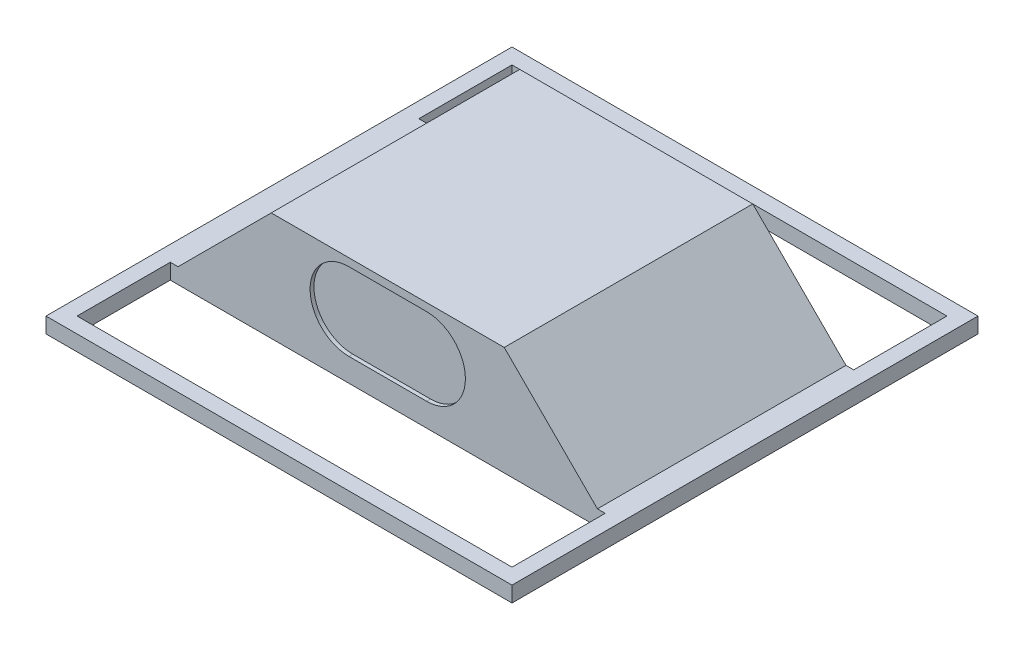
ISO-10303-21;
HEADER;
FILE_DESCRIPTION(('STEP AP214'),'2;1');
FILE_NAME('part.step','',(''),(''),'','','');
FILE_SCHEMA(('AUTOMOTIVE_DESIGN { 1 0 10303 214 1 1 1 1 }'));
ENDSEC;
DATA;
#1=APPLICATION_CONTEXT('core data for automotive mechanical design processes');
#2=APPLICATION_PROTOCOL_DEFINITION('international standard','automotive_design',2000,#1);
#3=PRODUCT_CONTEXT('',#1,'mechanical');
#4=PRODUCT('Part','Part','',(#3));
#5=PRODUCT_RELATED_PRODUCT_CATEGORY('part','',(#4));
#6=PRODUCT_DEFINITION_FORMATION('','',#4);
#7=PRODUCT_DEFINITION_CONTEXT('part definition',#1,'design');
#8=PRODUCT_DEFINITION('design','',#6,#7);
#9=PRODUCT_DEFINITION_SHAPE('','',#8);
#10=(LENGTH_UNIT() NAMED_UNIT(*) SI_UNIT(.MILLI.,.METRE.));
#11=(NAMED_UNIT(*) PLANE_ANGLE_UNIT() SI_UNIT($,.RADIAN.));
#12=(NAMED_UNIT(*) SI_UNIT($,.STERADIAN.) SOLID_ANGLE_UNIT());
#13=UNCERTAINTY_MEASURE_WITH_UNIT(LENGTH_MEASURE(1.E-05),#10,'distance_accuracy_value','');
#14=(GEOMETRIC_REPRESENTATION_CONTEXT(3) GLOBAL_UNCERTAINTY_ASSIGNED_CONTEXT((#13)) GLOBAL_UNIT_ASSIGNED_CONTEXT((#10,
#11,#12)) REPRESENTATION_CONTEXT('',''));
#15=CARTESIAN_POINT('',(0.,0.,0.));
#16=DIRECTION('',(0.,0.,1.));
#17=DIRECTION('',(1.,0.,0.));
#18=AXIS2_PLACEMENT_3D('',#15,#16,#17);
#19=CARTESIAN_POINT('',(0.,20.,0.));
#20=DIRECTION('',(0.,1.,0.));
#21=DIRECTION('',(0.,0.,1.));
#22=AXIS2_PLACEMENT_3D('',#19,#20,#21);
#23=PLANE('',#22);
#24=DIRECTION('',(0.,0.,1.));
#25=VECTOR('',#24,1.);
#26=CARTESIAN_POINT('',(-269.999999999996,20.,-160.));
#27=LINE('',#26,#25);
#28=CARTESIAN_POINT('',(-269.999999999996,20.,-160.));
#29=VERTEX_POINT('',#28);
#30=CARTESIAN_POINT('',(-269.999999999996,20.,160.));
#31=VERTEX_POINT('',#30);
#32=EDGE_CURVE('E282',#29,#31,#27,.T.);
#33=ORIENTED_EDGE('',*,*,#32,.F.);
#34=DIRECTION('',(1.,0.,0.));
#35=VECTOR('',#34,1.);
#36=CARTESIAN_POINT('',(-280.,20.,-160.));
#37=LINE('',#36,#35);
#38=CARTESIAN_POINT('',(-280.,20.,-160.));
#39=VERTEX_POINT('',#38);
#40=EDGE_CURVE('E292',#39,#29,#37,.T.);
#41=ORIENTED_EDGE('',*,*,#40,.F.);
#42=DIRECTION('',(0.,0.,1.));
#43=VECTOR('',#42,1.);
#44=CARTESIAN_POINT('',(-280.,20.,-160.));
#45=LINE('',#44,#43);
#46=CARTESIAN_POINT('',(-280.,20.,-280.));
#47=VERTEX_POINT('',#46);
#48=EDGE_CURVE('E301',#47,#39,#45,.T.);
#49=ORIENTED_EDGE('',*,*,#48,.F.);
#50=DIRECTION('',(-1.,0.,0.));
#51=VECTOR('',#50,1.);
#52=CARTESIAN_POINT('',(-280.,20.,-280.));
#53=LINE('',#52,#51);
#54=CARTESIAN_POINT('',(280.,20.,-280.));
#55=VERTEX_POINT('',#54);
#56=EDGE_CURVE('E298',#55,#47,#53,.T.);
#57=ORIENTED_EDGE('',*,*,#56,.F.);
#58=DIRECTION('',(0.,0.,-1.));
#59=VECTOR('',#58,1.);
#60=CARTESIAN_POINT('',(280.,20.,-160.));
#61=LINE('',#60,#59);
#62=CARTESIAN_POINT('',(280.,20.,-160.));
#63=VERTEX_POINT('',#62);
#64=EDGE_CURVE('E295',#63,#55,#61,.T.);
#65=ORIENTED_EDGE('',*,*,#64,.F.);
#66=CARTESIAN_POINT('',(269.999999999996,20.,-160.));
#67=VERTEX_POINT('',#66);
#68=EDGE_CURVE('E296',#67,#63,#37,.T.);
#69=ORIENTED_EDGE('',*,*,#68,.F.);
#70=DIRECTION('',(0.,0.,1.));
#71=VECTOR('',#70,1.);
#72=CARTESIAN_POINT('',(269.999999999996,20.,-160.));
#73=LINE('',#72,#71);
#74=CARTESIAN_POINT('',(269.999999999996,20.,160.));
#75=VERTEX_POINT('',#74);
#76=EDGE_CURVE('E275',#67,#75,#73,.T.);
#77=ORIENTED_EDGE('',*,*,#76,.T.);
#78=DIRECTION('',(-1.,0.,0.));
#79=VECTOR('',#78,1.);
#80=CARTESIAN_POINT('',(-280.,20.,160.));
#81=LINE('',#80,#79);
#82=CARTESIAN_POINT('',(280.,20.,160.));
#83=VERTEX_POINT('',#82);
#84=EDGE_CURVE('E333',#83,#75,#81,.T.);
#85=ORIENTED_EDGE('',*,*,#84,.F.);
#86=DIRECTION('',(0.,0.,-1.));
#87=VECTOR('',#86,1.);
#88=CARTESIAN_POINT('',(280.,20.,160.));
#89=LINE('',#88,#87);
#90=CARTESIAN_POINT('',(280.,20.,280.));
#91=VERTEX_POINT('',#90);
#92=EDGE_CURVE('E329',#91,#83,#89,.T.);
#93=ORIENTED_EDGE('',*,*,#92,.F.);
#94=DIRECTION('',(1.,0.,0.));
#95=VECTOR('',#94,1.);
#96=CARTESIAN_POINT('',(-280.,20.,280.));
#97=LINE('',#96,#95);
#98=CARTESIAN_POINT('',(-280.,20.,280.));
#99=VERTEX_POINT('',#98);
#100=EDGE_CURVE('E326',#99,#91,#97,.T.);
#101=ORIENTED_EDGE('',*,*,#100,.F.);
#102=DIRECTION('',(0.,0.,1.));
#103=VECTOR('',#102,1.);
#104=CARTESIAN_POINT('',(-280.,20.,160.));
#105=LINE('',#104,#103);
#106=CARTESIAN_POINT('',(-280.,20.,160.));
#107=VERTEX_POINT('',#106);
#108=EDGE_CURVE('E324',#107,#99,#105,.T.);
#109=ORIENTED_EDGE('',*,*,#108,.F.);
#110=EDGE_CURVE('E332',#31,#107,#81,.T.);
#111=ORIENTED_EDGE('',*,*,#110,.F.);
#112=EDGE_LOOP('',(#33,#41,#49,#57,#65,#69,#77,#85,#93,#101,#109,#111));
#113=FACE_BOUND('',#112,.T.);
#114=DIRECTION('',(-1.,0.,0.));
#115=VECTOR('',#114,1.);
#116=CARTESIAN_POINT('',(-300.,20.,-300.));
#117=LINE('',#116,#115);
#118=CARTESIAN_POINT('',(300.,20.,-300.));
#119=VERTEX_POINT('',#118);
#120=CARTESIAN_POINT('',(-300.,20.,-300.));
#121=VERTEX_POINT('',#120);
#122=EDGE_CURVE('E356',#119,#121,#117,.T.);
#123=ORIENTED_EDGE('',*,*,#122,.T.);
#124=DIRECTION('',(0.,0.,1.));
#125=VECTOR('',#124,1.);
#126=CARTESIAN_POINT('',(-300.,20.,300.));
#127=LINE('',#126,#125);
#128=CARTESIAN_POINT('',(-300.,20.,300.));
#129=VERTEX_POINT('',#128);
#130=EDGE_CURVE('E359',#121,#129,#127,.T.);
#131=ORIENTED_EDGE('',*,*,#130,.T.);
#132=DIRECTION('',(1.,0.,0.));
#133=VECTOR('',#132,1.);
#134=CARTESIAN_POINT('',(-300.,20.,300.));
#135=LINE('',#134,#133);
#136=CARTESIAN_POINT('',(300.,20.,300.));
#137=VERTEX_POINT('',#136);
#138=EDGE_CURVE('E362',#129,#137,#135,.T.);
#139=ORIENTED_EDGE('',*,*,#138,.T.);
#140=DIRECTION('',(0.,0.,-1.));
#141=VECTOR('',#140,1.);
#142=CARTESIAN_POINT('',(300.,20.,300.));
#143=LINE('',#142,#141);
#144=EDGE_CURVE('E364',#137,#119,#143,.T.);
#145=ORIENTED_EDGE('',*,*,#144,.T.);
#146=EDGE_LOOP('',(#123,#131,#139,#145));
#147=FACE_BOUND('',#146,.T.);
#148=ADVANCED_FACE('F36',(#113,#147),#23,.T.);
#149=CARTESIAN_POINT('',(0.,0.,0.));
#150=DIRECTION('',(0.,1.,0.));
#151=DIRECTION('',(0.,0.,1.));
#152=AXIS2_PLACEMENT_3D('',#149,#150,#151);
#153=PLANE('',#152);
#154=DIRECTION('',(-1.,0.,0.));
#155=VECTOR('',#154,1.);
#156=CARTESIAN_POINT('',(-280.,0.,160.));
#157=LINE('',#156,#155);
#158=CARTESIAN_POINT('',(280.,0.,160.));
#159=VERTEX_POINT('',#158);
#160=CARTESIAN_POINT('',(-280.,0.,160.));
#161=VERTEX_POINT('',#160);
#162=EDGE_CURVE('E327',#159,#161,#157,.T.);
#163=ORIENTED_EDGE('',*,*,#162,.T.);
#164=DIRECTION('',(0.,0.,1.));
#165=VECTOR('',#164,1.);
#166=CARTESIAN_POINT('',(-280.,0.,160.));
#167=LINE('',#166,#165);
#168=CARTESIAN_POINT('',(-280.,0.,280.));
#169=VERTEX_POINT('',#168);
#170=EDGE_CURVE('E323',#161,#169,#167,.T.);
#171=ORIENTED_EDGE('',*,*,#170,.T.);
#172=DIRECTION('',(1.,0.,0.));
#173=VECTOR('',#172,1.);
#174=CARTESIAN_POINT('',(-280.,0.,280.));
#175=LINE('',#174,#173);
#176=CARTESIAN_POINT('',(280.,0.,280.));
#177=VERTEX_POINT('',#176);
#178=EDGE_CURVE('E339',#169,#177,#175,.T.);
#179=ORIENTED_EDGE('',*,*,#178,.T.);
#180=DIRECTION('',(0.,0.,-1.));
#181=VECTOR('',#180,1.);
#182=CARTESIAN_POINT('',(280.,0.,160.));
#183=LINE('',#182,#181);
#184=EDGE_CURVE('E342',#177,#159,#183,.T.);
#185=ORIENTED_EDGE('',*,*,#184,.T.);
#186=EDGE_LOOP('',(#163,#171,#179,#185));
#187=FACE_BOUND('',#186,.T.);
#188=DIRECTION('',(1.,0.,0.));
#189=VECTOR('',#188,1.);
#190=CARTESIAN_POINT('',(-280.,0.,-160.));
#191=LINE('',#190,#189);
#192=CARTESIAN_POINT('',(-280.,0.,-160.));
#193=VERTEX_POINT('',#192);
#194=CARTESIAN_POINT('',(280.,0.,-160.));
#195=VERTEX_POINT('',#194);
#196=EDGE_CURVE('E285',#193,#195,#191,.T.);
#197=ORIENTED_EDGE('',*,*,#196,.T.);
#198=DIRECTION('',(0.,0.,-1.));
#199=VECTOR('',#198,1.);
#200=CARTESIAN_POINT('',(280.,0.,-160.));
#201=LINE('',#200,#199);
#202=CARTESIAN_POINT('',(280.,0.,-280.));
#203=VERTEX_POINT('',#202);
#204=EDGE_CURVE('E305',#195,#203,#201,.T.);
#205=ORIENTED_EDGE('',*,*,#204,.T.);
#206=DIRECTION('',(-1.,0.,0.));
#207=VECTOR('',#206,1.);
#208=CARTESIAN_POINT('',(-280.,0.,-280.));
#209=LINE('',#208,#207);
#210=CARTESIAN_POINT('',(-280.,0.,-280.));
#211=VERTEX_POINT('',#210);
#212=EDGE_CURVE('E308',#203,#211,#209,.T.);
#213=ORIENTED_EDGE('',*,*,#212,.T.);
#214=DIRECTION('',(0.,0.,1.));
#215=VECTOR('',#214,1.);
#216=CARTESIAN_POINT('',(-280.,0.,-160.));
#217=LINE('',#216,#215);
#218=EDGE_CURVE('E311',#211,#193,#217,.T.);
#219=ORIENTED_EDGE('',*,*,#218,.T.);
#220=EDGE_LOOP('',(#197,#205,#213,#219));
#221=FACE_BOUND('',#220,.T.);
#222=DIRECTION('',(-1.,0.,0.));
#223=VECTOR('',#222,1.);
#224=CARTESIAN_POINT('',(-300.,0.,-300.));
#225=LINE('',#224,#223);
#226=CARTESIAN_POINT('',(300.,0.,-300.));
#227=VERTEX_POINT('',#226);
#228=CARTESIAN_POINT('',(-300.,0.,-300.));
#229=VERTEX_POINT('',#228);
#230=EDGE_CURVE('E355',#227,#229,#225,.T.);
#231=ORIENTED_EDGE('',*,*,#230,.F.);
#232=DIRECTION('',(0.,0.,-1.));
#233=VECTOR('',#232,1.);
#234=CARTESIAN_POINT('',(300.,0.,300.));
#235=LINE('',#234,#233);
#236=CARTESIAN_POINT('',(300.,0.,300.));
#237=VERTEX_POINT('',#236);
#238=EDGE_CURVE('E360',#237,#227,#235,.T.);
#239=ORIENTED_EDGE('',*,*,#238,.F.);
#240=DIRECTION('',(1.,0.,0.));
#241=VECTOR('',#240,1.);
#242=CARTESIAN_POINT('',(-300.,0.,300.));
#243=LINE('',#242,#241);
#244=CARTESIAN_POINT('',(-300.,0.,300.));
#245=VERTEX_POINT('',#244);
#246=EDGE_CURVE('E371',#245,#237,#243,.T.);
#247=ORIENTED_EDGE('',*,*,#246,.F.);
#248=DIRECTION('',(0.,0.,1.));
#249=VECTOR('',#248,1.);
#250=CARTESIAN_POINT('',(-300.,0.,300.));
#251=LINE('',#250,#249);
#252=EDGE_CURVE('E369',#229,#245,#251,.T.);
#253=ORIENTED_EDGE('',*,*,#252,.F.);
#254=EDGE_LOOP('',(#231,#239,#247,#253));
#255=FACE_BOUND('',#254,.T.);
#256=ADVANCED_FACE('F389',(#187,#221,#255),#153,.F.);
#257=CARTESIAN_POINT('',(-300.,20.,-300.));
#258=DIRECTION('',(0.,0.,1.));
#259=DIRECTION('',(1.,0.,0.));
#260=AXIS2_PLACEMENT_3D('',#257,#258,#259);
#261=PLANE('',#260);
#262=ORIENTED_EDGE('',*,*,#230,.T.);
#263=DIRECTION('',(0.,-1.,0.));
#264=VECTOR('',#263,1.);
#265=CARTESIAN_POINT('',(-300.,20.,-300.));
#266=LINE('',#265,#264);
#267=EDGE_CURVE('E11',#121,#229,#266,.T.);
#268=ORIENTED_EDGE('',*,*,#267,.F.);
#269=ORIENTED_EDGE('',*,*,#122,.F.);
#270=DIRECTION('',(0.,-1.,0.));
#271=VECTOR('',#270,1.);
#272=CARTESIAN_POINT('',(300.,20.,-300.));
#273=LINE('',#272,#271);
#274=EDGE_CURVE('E366',#119,#227,#273,.T.);
#275=ORIENTED_EDGE('',*,*,#274,.T.);
#276=EDGE_LOOP('',(#262,#268,#269,#275));
#277=FACE_BOUND('',#276,.T.);
#278=ADVANCED_FACE('F38',(#277),#261,.F.);
#279=CARTESIAN_POINT('',(-300.,20.,300.));
#280=DIRECTION('',(1.,0.,0.));
#281=DIRECTION('',(0.,0.,-1.));
#282=AXIS2_PLACEMENT_3D('',#279,#280,#281);
#283=PLANE('',#282);
#284=ORIENTED_EDGE('',*,*,#252,.T.);
#285=DIRECTION('',(0.,-1.,0.));
#286=VECTOR('',#285,1.);
#287=CARTESIAN_POINT('',(-300.,20.,300.));
#288=LINE('',#287,#286);
#289=EDGE_CURVE('E44',#129,#245,#288,.T.);
#290=ORIENTED_EDGE('',*,*,#289,.F.);
#291=ORIENTED_EDGE('',*,*,#130,.F.);
#292=ORIENTED_EDGE('',*,*,#267,.T.);
#293=EDGE_LOOP('',(#284,#290,#291,#292));
#294=FACE_BOUND('',#293,.T.);
#295=ADVANCED_FACE('F398',(#294),#283,.F.);
#296=CARTESIAN_POINT('',(-300.,20.,300.));
#297=DIRECTION('',(0.,0.,-1.));
#298=DIRECTION('',(-1.,0.,0.));
#299=AXIS2_PLACEMENT_3D('',#296,#297,#298);
#300=PLANE('',#299);
#301=ORIENTED_EDGE('',*,*,#246,.T.);
#302=DIRECTION('',(0.,-1.,0.));
#303=VECTOR('',#302,1.);
#304=CARTESIAN_POINT('',(300.,20.,300.));
#305=LINE('',#304,#303);
#306=EDGE_CURVE('E376',#137,#237,#305,.T.);
#307=ORIENTED_EDGE('',*,*,#306,.F.);
#308=ORIENTED_EDGE('',*,*,#138,.F.);
#309=ORIENTED_EDGE('',*,*,#289,.T.);
#310=EDGE_LOOP('',(#301,#307,#308,#309));
#311=FACE_BOUND('',#310,.T.);
#312=ADVANCED_FACE('F383',(#311),#300,.F.);
#313=CARTESIAN_POINT('',(300.,20.,300.));
#314=DIRECTION('',(-1.,0.,0.));
#315=DIRECTION('',(0.,0.,1.));
#316=AXIS2_PLACEMENT_3D('',#313,#314,#315);
#317=PLANE('',#316);
#318=ORIENTED_EDGE('',*,*,#238,.T.);
#319=ORIENTED_EDGE('',*,*,#274,.F.);
#320=ORIENTED_EDGE('',*,*,#144,.F.);
#321=ORIENTED_EDGE('',*,*,#306,.T.);
#322=EDGE_LOOP('',(#318,#319,#320,#321));
#323=FACE_BOUND('',#322,.T.);
#324=ADVANCED_FACE('F392',(#323),#317,.F.);
#325=CARTESIAN_POINT('',(-280.,20.,160.));
#326=DIRECTION('',(1.,0.,0.));
#327=DIRECTION('',(0.,0.,-1.));
#328=AXIS2_PLACEMENT_3D('',#325,#326,#327);
#329=PLANE('',#328);
#330=ORIENTED_EDGE('',*,*,#170,.F.);
#331=DIRECTION('',(0.,-1.,0.));
#332=VECTOR('',#331,1.);
#333=CARTESIAN_POINT('',(-280.,20.,160.));
#334=LINE('',#333,#332);
#335=EDGE_CURVE('E336',#107,#161,#334,.T.);
#336=ORIENTED_EDGE('',*,*,#335,.F.);
#337=ORIENTED_EDGE('',*,*,#108,.T.);
#338=DIRECTION('',(0.,-1.,0.));
#339=VECTOR('',#338,1.);
#340=CARTESIAN_POINT('',(-280.,20.,280.));
#341=LINE('',#340,#339);
#342=EDGE_CURVE('E352',#99,#169,#341,.T.);
#343=ORIENTED_EDGE('',*,*,#342,.T.);
#344=EDGE_LOOP('',(#330,#336,#337,#343));
#345=FACE_BOUND('',#344,.T.);
#346=ADVANCED_FACE('F415',(#345),#329,.T.);
#347=CARTESIAN_POINT('',(-280.,20.,280.));
#348=DIRECTION('',(0.,0.,-1.));
#349=DIRECTION('',(-1.,0.,0.));
#350=AXIS2_PLACEMENT_3D('',#347,#348,#349);
#351=PLANE('',#350);
#352=ORIENTED_EDGE('',*,*,#178,.F.);
#353=ORIENTED_EDGE('',*,*,#342,.F.);
#354=ORIENTED_EDGE('',*,*,#100,.T.);
#355=DIRECTION('',(0.,-1.,0.));
#356=VECTOR('',#355,1.);
#357=CARTESIAN_POINT('',(280.,20.,280.));
#358=LINE('',#357,#356);
#359=EDGE_CURVE('E350',#91,#177,#358,.T.);
#360=ORIENTED_EDGE('',*,*,#359,.T.);
#361=EDGE_LOOP('',(#352,#353,#354,#360));
#362=FACE_BOUND('',#361,.T.);
#363=ADVANCED_FACE('F422',(#362),#351,.T.);
#364=CARTESIAN_POINT('',(280.,20.,160.));
#365=DIRECTION('',(-1.,0.,0.));
#366=DIRECTION('',(0.,0.,1.));
#367=AXIS2_PLACEMENT_3D('',#364,#365,#366);
#368=PLANE('',#367);
#369=ORIENTED_EDGE('',*,*,#184,.F.);
#370=ORIENTED_EDGE('',*,*,#359,.F.);
#371=ORIENTED_EDGE('',*,*,#92,.T.);
#372=DIRECTION('',(0.,-1.,0.));
#373=VECTOR('',#372,1.);
#374=CARTESIAN_POINT('',(280.,20.,160.));
#375=LINE('',#374,#373);
#376=EDGE_CURVE('E348',#83,#159,#375,.T.);
#377=ORIENTED_EDGE('',*,*,#376,.T.);
#378=EDGE_LOOP('',(#369,#370,#371,#377));
#379=FACE_BOUND('',#378,.T.);
#380=ADVANCED_FACE('F427',(#379),#368,.T.);
#381=CARTESIAN_POINT('',(-280.,20.,160.));
#382=DIRECTION('',(0.,0.,1.));
#383=DIRECTION('',(1.,0.,0.));
#384=AXIS2_PLACEMENT_3D('',#381,#382,#383);
#385=PLANE('',#384);
#386=CARTESIAN_POINT('',(50.,80.,160.));
#387=DIRECTION('',(0.,0.,1.));
#388=DIRECTION('',(-1.,0.,0.));
#389=AXIS2_PLACEMENT_3D('',#386,#387,#388);
#390=CIRCLE('',#389,50.);
#391=CARTESIAN_POINT('',(50.,30.,160.));
#392=VERTEX_POINT('',#391);
#393=CARTESIAN_POINT('',(50.,130.,160.));
#394=VERTEX_POINT('',#393);
#395=EDGE_CURVE('E59',#392,#394,#390,.T.);
#396=ORIENTED_EDGE('',*,*,#395,.F.);
#397=DIRECTION('',(1.,0.,0.));
#398=VECTOR('',#397,1.);
#399=CARTESIAN_POINT('',(50.,30.,160.));
#400=LINE('',#399,#398);
#401=CARTESIAN_POINT('',(-50.,30.,160.));
#402=VERTEX_POINT('',#401);
#403=EDGE_CURVE('E239',#402,#392,#400,.T.);
#404=ORIENTED_EDGE('',*,*,#403,.F.);
#405=CARTESIAN_POINT('',(-50.,80.,160.));
#406=DIRECTION('',(0.,0.,1.));
#407=DIRECTION('',(1.,0.,0.));
#408=AXIS2_PLACEMENT_3D('',#405,#406,#407);
#409=CIRCLE('',#408,50.);
#410=CARTESIAN_POINT('',(-50.,130.,160.));
#411=VERTEX_POINT('',#410);
#412=EDGE_CURVE('E253',#411,#402,#409,.T.);
#413=ORIENTED_EDGE('',*,*,#412,.F.);
#414=DIRECTION('',(-1.,0.,0.));
#415=VECTOR('',#414,1.);
#416=CARTESIAN_POINT('',(50.,130.,160.));
#417=LINE('',#416,#415);
#418=EDGE_CURVE('E250',#394,#411,#417,.T.);
#419=ORIENTED_EDGE('',*,*,#418,.F.);
#420=EDGE_LOOP('',(#396,#404,#413,#419));
#421=FACE_BOUND('',#420,.T.);
#422=ORIENTED_EDGE('',*,*,#84,.T.);
#423=DIRECTION('',(-0.707106781186537,0.707106781186558,0.));
#424=VECTOR('',#423,1.);
#425=CARTESIAN_POINT('',(150.,140.,160.));
#426=LINE('',#425,#424);
#427=CARTESIAN_POINT('',(150.,140.,160.));
#428=VERTEX_POINT('',#427);
#429=EDGE_CURVE('E260',#75,#428,#426,.T.);
#430=ORIENTED_EDGE('',*,*,#429,.T.);
#431=DIRECTION('',(-1.,0.,0.));
#432=VECTOR('',#431,1.);
#433=CARTESIAN_POINT('',(150.,140.,160.));
#434=LINE('',#433,#432);
#435=CARTESIAN_POINT('',(-150.,140.,160.));
#436=VERTEX_POINT('',#435);
#437=EDGE_CURVE('E278',#428,#436,#434,.T.);
#438=ORIENTED_EDGE('',*,*,#437,.T.);
#439=DIRECTION('',(-0.707106781186536,-0.707106781186559,0.));
#440=VECTOR('',#439,1.);
#441=CARTESIAN_POINT('',(-150.,140.,160.));
#442=LINE('',#441,#440);
#443=EDGE_CURVE('E270',#436,#31,#442,.T.);
#444=ORIENTED_EDGE('',*,*,#443,.T.);
#445=ORIENTED_EDGE('',*,*,#110,.T.);
#446=ORIENTED_EDGE('',*,*,#335,.T.);
#447=ORIENTED_EDGE('',*,*,#162,.F.);
#448=ORIENTED_EDGE('',*,*,#376,.F.);
#449=EDGE_LOOP('',(#422,#430,#438,#444,#445,#446,#447,#448));
#450=FACE_BOUND('',#449,.T.);
#451=ADVANCED_FACE('F435',(#421,#450),#385,.T.);
#452=CARTESIAN_POINT('',(-280.,20.,-160.));
#453=DIRECTION('',(0.,0.,-1.));
#454=DIRECTION('',(-1.,0.,0.));
#455=AXIS2_PLACEMENT_3D('',#452,#453,#454);
#456=PLANE('',#455);
#457=CARTESIAN_POINT('',(-50.,80.,-160.));
#458=DIRECTION('',(0.,0.,-1.));
#459=DIRECTION('',(-1.,0.,0.));
#460=AXIS2_PLACEMENT_3D('',#457,#458,#459);
#461=CIRCLE('',#460,50.);
#462=CARTESIAN_POINT('',(-50.,30.,-160.));
#463=VERTEX_POINT('',#462);
#464=CARTESIAN_POINT('',(-50.,130.,-160.));
#465=VERTEX_POINT('',#464);
#466=EDGE_CURVE('E51',#463,#465,#461,.T.);
#467=ORIENTED_EDGE('',*,*,#466,.F.);
#468=DIRECTION('',(-1.,0.,0.));
#469=VECTOR('',#468,1.);
#470=CARTESIAN_POINT('',(-280.,30.,-160.));
#471=LINE('',#470,#469);
#472=CARTESIAN_POINT('',(50.,30.,-160.));
#473=VERTEX_POINT('',#472);
#474=EDGE_CURVE('E217',#473,#463,#471,.T.);
#475=ORIENTED_EDGE('',*,*,#474,.F.);
#476=CARTESIAN_POINT('',(50.,80.,-160.));
#477=DIRECTION('',(0.,0.,-1.));
#478=DIRECTION('',(-1.,0.,0.));
#479=AXIS2_PLACEMENT_3D('',#476,#477,#478);
#480=CIRCLE('',#479,50.);
#481=CARTESIAN_POINT('',(50.,130.,-160.));
#482=VERTEX_POINT('',#481);
#483=EDGE_CURVE('E220',#482,#473,#480,.T.);
#484=ORIENTED_EDGE('',*,*,#483,.F.);
#485=DIRECTION('',(1.,0.,0.));
#486=VECTOR('',#485,1.);
#487=CARTESIAN_POINT('',(-280.,130.,-160.));
#488=LINE('',#487,#486);
#489=EDGE_CURVE('E226',#465,#482,#488,.T.);
#490=ORIENTED_EDGE('',*,*,#489,.F.);
#491=EDGE_LOOP('',(#467,#475,#484,#490));
#492=FACE_BOUND('',#491,.T.);
#493=DIRECTION('',(0.,-1.,0.));
#494=VECTOR('',#493,1.);
#495=CARTESIAN_POINT('',(280.,20.,-160.));
#496=LINE('',#495,#494);
#497=EDGE_CURVE('E320',#63,#195,#496,.T.);
#498=ORIENTED_EDGE('',*,*,#497,.T.);
#499=ORIENTED_EDGE('',*,*,#196,.F.);
#500=DIRECTION('',(0.,-1.,0.));
#501=VECTOR('',#500,1.);
#502=CARTESIAN_POINT('',(-280.,20.,-160.));
#503=LINE('',#502,#501);
#504=EDGE_CURVE('E303',#39,#193,#503,.T.);
#505=ORIENTED_EDGE('',*,*,#504,.F.);
#506=ORIENTED_EDGE('',*,*,#40,.T.);
#507=DIRECTION('',(-0.707106781186536,-0.707106781186559,0.));
#508=VECTOR('',#507,1.);
#509=CARTESIAN_POINT('',(-150.,140.,-160.));
#510=LINE('',#509,#508);
#511=CARTESIAN_POINT('',(-150.,140.,-160.));
#512=VERTEX_POINT('',#511);
#513=EDGE_CURVE('E273',#512,#29,#510,.T.);
#514=ORIENTED_EDGE('',*,*,#513,.F.);
#515=DIRECTION('',(-1.,0.,0.));
#516=VECTOR('',#515,1.);
#517=CARTESIAN_POINT('',(150.,140.,-160.));
#518=LINE('',#517,#516);
#519=CARTESIAN_POINT('',(150.,140.,-160.));
#520=VERTEX_POINT('',#519);
#521=EDGE_CURVE('E269',#520,#512,#518,.T.);
#522=ORIENTED_EDGE('',*,*,#521,.F.);
#523=DIRECTION('',(-0.707106781186537,0.707106781186558,0.));
#524=VECTOR('',#523,1.);
#525=CARTESIAN_POINT('',(150.,140.,-160.));
#526=LINE('',#525,#524);
#527=EDGE_CURVE('E266',#67,#520,#526,.T.);
#528=ORIENTED_EDGE('',*,*,#527,.F.);
#529=ORIENTED_EDGE('',*,*,#68,.T.);
#530=EDGE_LOOP('',(#498,#499,#505,#506,#514,#522,#528,#529));
#531=FACE_BOUND('',#530,.T.);
#532=ADVANCED_FACE('F453',(#492,#531),#456,.T.);
#533=CARTESIAN_POINT('',(280.,20.,-160.));
#534=DIRECTION('',(-1.,0.,0.));
#535=DIRECTION('',(0.,0.,1.));
#536=AXIS2_PLACEMENT_3D('',#533,#534,#535);
#537=PLANE('',#536);
#538=ORIENTED_EDGE('',*,*,#204,.F.);
#539=ORIENTED_EDGE('',*,*,#497,.F.);
#540=ORIENTED_EDGE('',*,*,#64,.T.);
#541=DIRECTION('',(0.,-1.,0.));
#542=VECTOR('',#541,1.);
#543=CARTESIAN_POINT('',(280.,20.,-280.));
#544=LINE('',#543,#542);
#545=EDGE_CURVE('E318',#55,#203,#544,.T.);
#546=ORIENTED_EDGE('',*,*,#545,.T.);
#547=EDGE_LOOP('',(#538,#539,#540,#546));
#548=FACE_BOUND('',#547,.T.);
#549=ADVANCED_FACE('F480',(#548),#537,.T.);
#550=CARTESIAN_POINT('',(-280.,20.,-280.));
#551=DIRECTION('',(0.,0.,1.));
#552=DIRECTION('',(1.,0.,0.));
#553=AXIS2_PLACEMENT_3D('',#550,#551,#552);
#554=PLANE('',#553);
#555=ORIENTED_EDGE('',*,*,#212,.F.);
#556=ORIENTED_EDGE('',*,*,#545,.F.);
#557=ORIENTED_EDGE('',*,*,#56,.T.);
#558=DIRECTION('',(0.,-1.,0.));
#559=VECTOR('',#558,1.);
#560=CARTESIAN_POINT('',(-280.,20.,-280.));
#561=LINE('',#560,#559);
#562=EDGE_CURVE('E316',#47,#211,#561,.T.);
#563=ORIENTED_EDGE('',*,*,#562,.T.);
#564=EDGE_LOOP('',(#555,#556,#557,#563));
#565=FACE_BOUND('',#564,.T.);
#566=ADVANCED_FACE('F469',(#565),#554,.T.);
#567=CARTESIAN_POINT('',(-280.,20.,-160.));
#568=DIRECTION('',(1.,0.,0.));
#569=DIRECTION('',(0.,0.,-1.));
#570=AXIS2_PLACEMENT_3D('',#567,#568,#569);
#571=PLANE('',#570);
#572=ORIENTED_EDGE('',*,*,#218,.F.);
#573=ORIENTED_EDGE('',*,*,#562,.F.);
#574=ORIENTED_EDGE('',*,*,#48,.T.);
#575=ORIENTED_EDGE('',*,*,#504,.T.);
#576=EDGE_LOOP('',(#572,#573,#574,#575));
#577=FACE_BOUND('',#576,.T.);
#578=ADVANCED_FACE('F462',(#577),#571,.T.);
#579=CARTESIAN_POINT('',(-150.,140.,-160.));
#580=DIRECTION('',(-0.707106781186559,0.707106781186536,0.));
#581=DIRECTION('',(-0.707106781186536,-0.707106781186559,0.));
#582=AXIS2_PLACEMENT_3D('',#579,#580,#581);
#583=PLANE('',#582);
#584=ORIENTED_EDGE('',*,*,#443,.F.);
#585=DIRECTION('',(0.,0.,1.));
#586=VECTOR('',#585,1.);
#587=CARTESIAN_POINT('',(-150.,140.,-160.));
#588=LINE('',#587,#586);
#589=EDGE_CURVE('E286',#512,#436,#588,.T.);
#590=ORIENTED_EDGE('',*,*,#589,.F.);
#591=ORIENTED_EDGE('',*,*,#513,.T.);
#592=ORIENTED_EDGE('',*,*,#32,.T.);
#593=EDGE_LOOP('',(#584,#590,#591,#592));
#594=FACE_BOUND('',#593,.T.);
#595=ADVANCED_FACE('F460',(#594),#583,.T.);
#596=CARTESIAN_POINT('',(150.,140.,-160.));
#597=DIRECTION('',(0.,1.,0.));
#598=DIRECTION('',(-1.,0.,0.));
#599=AXIS2_PLACEMENT_3D('',#596,#597,#598);
#600=PLANE('',#599);
#601=ORIENTED_EDGE('',*,*,#437,.F.);
#602=DIRECTION('',(0.,0.,1.));
#603=VECTOR('',#602,1.);
#604=CARTESIAN_POINT('',(150.,140.,-160.));
#605=LINE('',#604,#603);
#606=EDGE_CURVE('E288',#520,#428,#605,.T.);
#607=ORIENTED_EDGE('',*,*,#606,.F.);
#608=ORIENTED_EDGE('',*,*,#521,.T.);
#609=ORIENTED_EDGE('',*,*,#589,.T.);
#610=EDGE_LOOP('',(#601,#607,#608,#609));
#611=FACE_BOUND('',#610,.T.);
#612=ADVANCED_FACE('F458',(#611),#600,.T.);
#613=CARTESIAN_POINT('',(150.,140.,-160.));
#614=DIRECTION('',(0.707106781186558,0.707106781186537,0.));
#615=DIRECTION('',(-0.707106781186537,0.707106781186558,0.));
#616=AXIS2_PLACEMENT_3D('',#613,#614,#615);
#617=PLANE('',#616);
#618=ORIENTED_EDGE('',*,*,#429,.F.);
#619=ORIENTED_EDGE('',*,*,#76,.F.);
#620=ORIENTED_EDGE('',*,*,#527,.T.);
#621=ORIENTED_EDGE('',*,*,#606,.T.);
#622=EDGE_LOOP('',(#618,#619,#620,#621));
#623=FACE_BOUND('',#622,.T.);
#624=ADVANCED_FACE('F450',(#623),#617,.T.);
#625=CARTESIAN_POINT('',(50.,80.,155.));
#626=DIRECTION('',(0.,0.,1.));
#627=DIRECTION('',(1.,0.,0.));
#628=AXIS2_PLACEMENT_3D('',#625,#626,#627);
#629=CYLINDRICAL_SURFACE('',#628,50.);
#630=ORIENTED_EDGE('',*,*,#395,.T.);
#631=DIRECTION('',(0.,0.,1.));
#632=VECTOR('',#631,1.);
#633=CARTESIAN_POINT('',(50.,130.,155.));
#634=LINE('',#633,#632);
#635=CARTESIAN_POINT('',(50.,130.,155.));
#636=VERTEX_POINT('',#635);
#637=EDGE_CURVE('E248',#636,#394,#634,.T.);
#638=ORIENTED_EDGE('',*,*,#637,.F.);
#639=CARTESIAN_POINT('',(50.,80.,155.));
#640=DIRECTION('',(0.,0.,1.));
#641=DIRECTION('',(-1.,0.,0.));
#642=AXIS2_PLACEMENT_3D('',#639,#640,#641);
#643=CIRCLE('',#642,50.);
#644=CARTESIAN_POINT('',(50.,30.,155.));
#645=VERTEX_POINT('',#644);
#646=EDGE_CURVE('E235',#645,#636,#643,.T.);
#647=ORIENTED_EDGE('',*,*,#646,.F.);
#648=DIRECTION('',(0.,0.,1.));
#649=VECTOR('',#648,1.);
#650=CARTESIAN_POINT('',(50.,30.,155.));
#651=LINE('',#650,#649);
#652=EDGE_CURVE('E258',#645,#392,#651,.T.);
#653=ORIENTED_EDGE('',*,*,#652,.T.);
#654=EDGE_LOOP('',(#630,#638,#647,#653));
#655=FACE_BOUND('',#654,.T.);
#656=ADVANCED_FACE('F473',(#655),#629,.F.);
#657=CARTESIAN_POINT('',(50.,30.,155.));
#658=DIRECTION('',(0.,-1.,0.));
#659=DIRECTION('',(0.,0.,-1.));
#660=AXIS2_PLACEMENT_3D('',#657,#658,#659);
#661=PLANE('',#660);
#662=ORIENTED_EDGE('',*,*,#403,.T.);
#663=ORIENTED_EDGE('',*,*,#652,.F.);
#664=DIRECTION('',(1.,0.,0.));
#665=VECTOR('',#664,1.);
#666=CARTESIAN_POINT('',(50.,30.,155.));
#667=LINE('',#666,#665);
#668=CARTESIAN_POINT('',(-50.,30.,155.));
#669=VERTEX_POINT('',#668);
#670=EDGE_CURVE('E245',#669,#645,#667,.T.);
#671=ORIENTED_EDGE('',*,*,#670,.F.);
#672=DIRECTION('',(0.,0.,1.));
#673=VECTOR('',#672,1.);
#674=CARTESIAN_POINT('',(-50.,30.,155.));
#675=LINE('',#674,#673);
#676=EDGE_CURVE('E261',#669,#402,#675,.T.);
#677=ORIENTED_EDGE('',*,*,#676,.T.);
#678=EDGE_LOOP('',(#662,#663,#671,#677));
#679=FACE_BOUND('',#678,.T.);
#680=ADVANCED_FACE('F554',(#679),#661,.F.);
#681=CARTESIAN_POINT('',(-50.,80.,155.));
#682=DIRECTION('',(0.,0.,1.));
#683=DIRECTION('',(1.,0.,0.));
#684=AXIS2_PLACEMENT_3D('',#681,#682,#683);
#685=CYLINDRICAL_SURFACE('',#684,50.);
#686=ORIENTED_EDGE('',*,*,#412,.T.);
#687=ORIENTED_EDGE('',*,*,#676,.F.);
#688=CARTESIAN_POINT('',(-50.,80.,155.));
#689=DIRECTION('',(0.,0.,1.));
#690=DIRECTION('',(1.,0.,0.));
#691=AXIS2_PLACEMENT_3D('',#688,#689,#690);
#692=CIRCLE('',#691,50.);
#693=CARTESIAN_POINT('',(-50.,130.,155.));
#694=VERTEX_POINT('',#693);
#695=EDGE_CURVE('E242',#694,#669,#692,.T.);
#696=ORIENTED_EDGE('',*,*,#695,.F.);
#697=DIRECTION('',(0.,0.,1.));
#698=VECTOR('',#697,1.);
#699=CARTESIAN_POINT('',(-50.,130.,155.));
#700=LINE('',#699,#698);
#701=EDGE_CURVE('E263',#694,#411,#700,.T.);
#702=ORIENTED_EDGE('',*,*,#701,.T.);
#703=EDGE_LOOP('',(#686,#687,#696,#702));
#704=FACE_BOUND('',#703,.T.);
#705=ADVANCED_FACE('F559',(#704),#685,.F.);
#706=CARTESIAN_POINT('',(50.,130.,155.));
#707=DIRECTION('',(0.,1.,0.));
#708=DIRECTION('',(0.,0.,1.));
#709=AXIS2_PLACEMENT_3D('',#706,#707,#708);
#710=PLANE('',#709);
#711=ORIENTED_EDGE('',*,*,#418,.T.);
#712=ORIENTED_EDGE('',*,*,#701,.F.);
#713=DIRECTION('',(-1.,0.,0.));
#714=VECTOR('',#713,1.);
#715=CARTESIAN_POINT('',(50.,130.,155.));
#716=LINE('',#715,#714);
#717=EDGE_CURVE('E238',#636,#694,#716,.T.);
#718=ORIENTED_EDGE('',*,*,#717,.F.);
#719=ORIENTED_EDGE('',*,*,#637,.T.);
#720=EDGE_LOOP('',(#711,#712,#718,#719));
#721=FACE_BOUND('',#720,.T.);
#722=ADVANCED_FACE('F567',(#721),#710,.F.);
#723=CARTESIAN_POINT('',(50.,80.,155.));
#724=DIRECTION('',(0.,0.,-1.));
#725=DIRECTION('',(-1.,0.,0.));
#726=AXIS2_PLACEMENT_3D('',#723,#724,#725);
#727=PLANE('',#726);
#728=ORIENTED_EDGE('',*,*,#646,.T.);
#729=ORIENTED_EDGE('',*,*,#717,.T.);
#730=ORIENTED_EDGE('',*,*,#695,.T.);
#731=ORIENTED_EDGE('',*,*,#670,.T.);
#732=EDGE_LOOP('',(#728,#729,#730,#731));
#733=FACE_BOUND('',#732,.T.);
#734=ADVANCED_FACE('F575',(#733),#727,.F.);
#735=CARTESIAN_POINT('',(-50.,80.,-155.));
#736=DIRECTION('',(0.,0.,-1.));
#737=DIRECTION('',(-1.,0.,0.));
#738=AXIS2_PLACEMENT_3D('',#735,#736,#737);
#739=CYLINDRICAL_SURFACE('',#738,50.);
#740=ORIENTED_EDGE('',*,*,#466,.T.);
#741=DIRECTION('',(0.,0.,-1.));
#742=VECTOR('',#741,1.);
#743=CARTESIAN_POINT('',(-50.,130.,-155.));
#744=LINE('',#743,#742);
#745=CARTESIAN_POINT('',(-50.,130.,-155.));
#746=VERTEX_POINT('',#745);
#747=EDGE_CURVE('E195',#746,#465,#744,.T.);
#748=ORIENTED_EDGE('',*,*,#747,.F.);
#749=CARTESIAN_POINT('',(-50.,80.,-155.));
#750=DIRECTION('',(0.,0.,-1.));
#751=DIRECTION('',(-1.,0.,0.));
#752=AXIS2_PLACEMENT_3D('',#749,#750,#751);
#753=CIRCLE('',#752,50.);
#754=CARTESIAN_POINT('',(-50.,30.,-155.));
#755=VERTEX_POINT('',#754);
#756=EDGE_CURVE('E199',#755,#746,#753,.T.);
#757=ORIENTED_EDGE('',*,*,#756,.F.);
#758=DIRECTION('',(0.,0.,-1.));
#759=VECTOR('',#758,1.);
#760=CARTESIAN_POINT('',(-50.,30.,-155.));
#761=LINE('',#760,#759);
#762=EDGE_CURVE('E230',#755,#463,#761,.T.);
#763=ORIENTED_EDGE('',*,*,#762,.T.);
#764=EDGE_LOOP('',(#740,#748,#757,#763));
#765=FACE_BOUND('',#764,.T.);
#766=ADVANCED_FACE('F197',(#765),#739,.F.);
#767=CARTESIAN_POINT('',(-280.,30.,-155.));
#768=DIRECTION('',(0.,-1.,0.));
#769=DIRECTION('',(0.,0.,-1.));
#770=AXIS2_PLACEMENT_3D('',#767,#768,#769);
#771=PLANE('',#770);
#772=ORIENTED_EDGE('',*,*,#474,.T.);
#773=ORIENTED_EDGE('',*,*,#762,.F.);
#774=DIRECTION('',(-1.,0.,0.));
#775=VECTOR('',#774,1.);
#776=CARTESIAN_POINT('',(-280.,30.,-155.));
#777=LINE('',#776,#775);
#778=CARTESIAN_POINT('',(50.,30.,-155.));
#779=VERTEX_POINT('',#778);
#780=EDGE_CURVE('E205',#779,#755,#777,.T.);
#781=ORIENTED_EDGE('',*,*,#780,.F.);
#782=DIRECTION('',(0.,0.,-1.));
#783=VECTOR('',#782,1.);
#784=CARTESIAN_POINT('',(50.,30.,-155.));
#785=LINE('',#784,#783);
#786=EDGE_CURVE('E232',#779,#473,#785,.T.);
#787=ORIENTED_EDGE('',*,*,#786,.T.);
#788=EDGE_LOOP('',(#772,#773,#781,#787));
#789=FACE_BOUND('',#788,.T.);
#790=ADVANCED_FACE('F587',(#789),#771,.F.);
#791=CARTESIAN_POINT('',(50.,80.,-155.));
#792=DIRECTION('',(0.,0.,-1.));
#793=DIRECTION('',(-1.,0.,0.));
#794=AXIS2_PLACEMENT_3D('',#791,#792,#793);
#795=CYLINDRICAL_SURFACE('',#794,50.);
#796=ORIENTED_EDGE('',*,*,#483,.T.);
#797=ORIENTED_EDGE('',*,*,#786,.F.);
#798=CARTESIAN_POINT('',(50.,80.,-155.));
#799=DIRECTION('',(0.,0.,-1.));
#800=DIRECTION('',(-1.,0.,0.));
#801=AXIS2_PLACEMENT_3D('',#798,#799,#800);
#802=CIRCLE('',#801,50.);
#803=CARTESIAN_POINT('',(50.,130.,-155.));
#804=VERTEX_POINT('',#803);
#805=EDGE_CURVE('E213',#804,#779,#802,.T.);
#806=ORIENTED_EDGE('',*,*,#805,.F.);
#807=DIRECTION('',(0.,0.,-1.));
#808=VECTOR('',#807,1.);
#809=CARTESIAN_POINT('',(50.,130.,-155.));
#810=LINE('',#809,#808);
#811=EDGE_CURVE('E204',#804,#482,#810,.T.);
#812=ORIENTED_EDGE('',*,*,#811,.T.);
#813=EDGE_LOOP('',(#796,#797,#806,#812));
#814=FACE_BOUND('',#813,.T.);
#815=ADVANCED_FACE('F594',(#814),#795,.F.);
#816=CARTESIAN_POINT('',(-280.,130.,-155.));
#817=DIRECTION('',(0.,1.,0.));
#818=DIRECTION('',(0.,0.,1.));
#819=AXIS2_PLACEMENT_3D('',#816,#817,#818);
#820=PLANE('',#819);
#821=ORIENTED_EDGE('',*,*,#489,.T.);
#822=ORIENTED_EDGE('',*,*,#811,.F.);
#823=DIRECTION('',(1.,0.,0.));
#824=VECTOR('',#823,1.);
#825=CARTESIAN_POINT('',(-280.,130.,-155.));
#826=LINE('',#825,#824);
#827=EDGE_CURVE('E208',#746,#804,#826,.T.);
#828=ORIENTED_EDGE('',*,*,#827,.F.);
#829=ORIENTED_EDGE('',*,*,#747,.T.);
#830=EDGE_LOOP('',(#821,#822,#828,#829));
#831=FACE_BOUND('',#830,.T.);
#832=ADVANCED_FACE('F209',(#831),#820,.F.);
#833=CARTESIAN_POINT('',(-50.,80.,-155.));
#834=DIRECTION('',(0.,0.,-1.));
#835=DIRECTION('',(-1.,0.,0.));
#836=AXIS2_PLACEMENT_3D('',#833,#834,#835);
#837=PLANE('',#836);
#838=ORIENTED_EDGE('',*,*,#756,.T.);
#839=ORIENTED_EDGE('',*,*,#827,.T.);
#840=ORIENTED_EDGE('',*,*,#805,.T.);
#841=ORIENTED_EDGE('',*,*,#780,.T.);
#842=EDGE_LOOP('',(#838,#839,#840,#841));
#843=FACE_BOUND('',#842,.T.);
#844=ADVANCED_FACE('F215',(#843),#837,.T.);
#845=CLOSED_SHELL('',(#148,#256,#278,#295,#312,#324,#346,#363,#380,#451,#532,#549,#566,#578,
#595,#612,#624,#656,#680,#705,#722,#734,#766,#790,#815,#832,#844));
#846=MANIFOLD_SOLID_BREP('B2',#845);
#847=ADVANCED_BREP_SHAPE_REPRESENTATION('',(#18,#846),#14);
#848=SHAPE_DEFINITION_REPRESENTATION(#9,#847);
ENDSEC;
END-ISO-10303-21;
